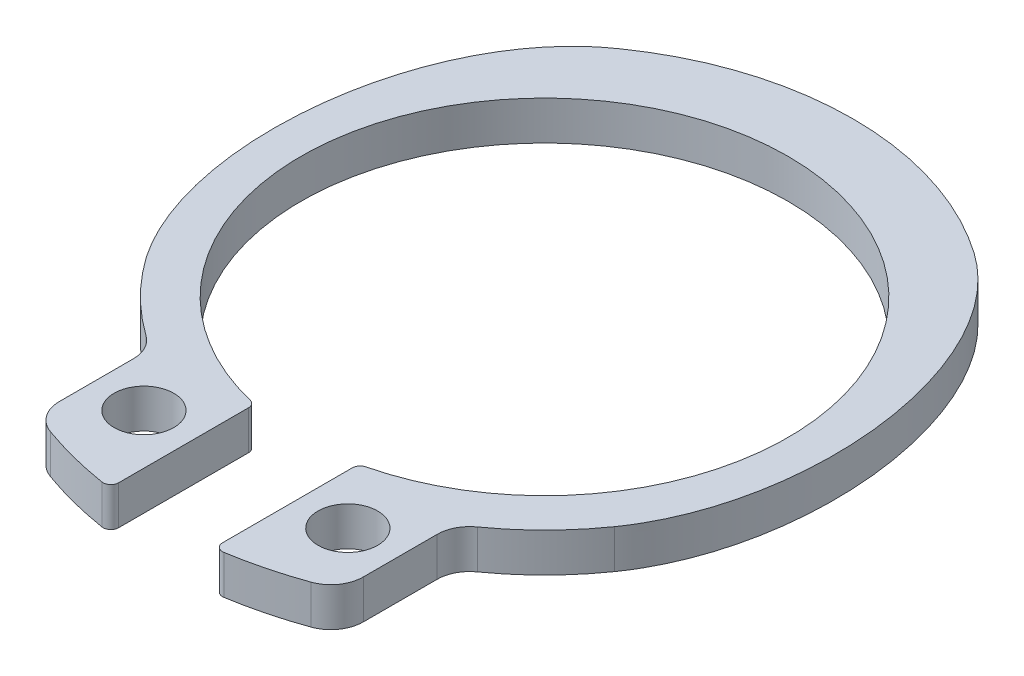
ISO-10303-21;
HEADER;
FILE_DESCRIPTION(('STEP AP214'),'2;1');
FILE_NAME('part.step','',(''),(''),'','','');
FILE_SCHEMA(('AUTOMOTIVE_DESIGN { 1 0 10303 214 1 1 1 1 }'));
ENDSEC;
DATA;
#1=APPLICATION_CONTEXT('core data for automotive mechanical design processes');
#2=APPLICATION_PROTOCOL_DEFINITION('international standard','automotive_design',2000,#1);
#3=PRODUCT_CONTEXT('',#1,'mechanical');
#4=PRODUCT('Part','Part','',(#3));
#5=PRODUCT_RELATED_PRODUCT_CATEGORY('part','',(#4));
#6=PRODUCT_DEFINITION_FORMATION('','',#4);
#7=PRODUCT_DEFINITION_CONTEXT('part definition',#1,'design');
#8=PRODUCT_DEFINITION('design','',#6,#7);
#9=PRODUCT_DEFINITION_SHAPE('','',#8);
#10=(LENGTH_UNIT() NAMED_UNIT(*) SI_UNIT(.MILLI.,.METRE.));
#11=(NAMED_UNIT(*) PLANE_ANGLE_UNIT() SI_UNIT($,.RADIAN.));
#12=(NAMED_UNIT(*) SI_UNIT($,.STERADIAN.) SOLID_ANGLE_UNIT());
#13=UNCERTAINTY_MEASURE_WITH_UNIT(LENGTH_MEASURE(1.E-05),#10,'distance_accuracy_value','');
#14=(GEOMETRIC_REPRESENTATION_CONTEXT(3) GLOBAL_UNCERTAINTY_ASSIGNED_CONTEXT((#13)) GLOBAL_UNIT_ASSIGNED_CONTEXT((#10,
#11,#12)) REPRESENTATION_CONTEXT('',''));
#15=CARTESIAN_POINT('',(0.,0.,0.));
#16=DIRECTION('',(0.,0.,1.));
#17=DIRECTION('',(1.,0.,0.));
#18=AXIS2_PLACEMENT_3D('',#15,#16,#17);
#19=CARTESIAN_POINT('',(-0.92,0.3,5.756952318719));
#20=DIRECTION('',(0.,-1.,0.));
#21=DIRECTION('',(0.,0.,-1.));
#22=AXIS2_PLACEMENT_3D('',#19,#20,#21);
#23=CYLINDRICAL_SURFACE('',#22,0.119999999999949);
#24=CARTESIAN_POINT('',(-0.92,-0.3,5.756952318719));
#25=DIRECTION('',(0.,-1.,0.));
#26=DIRECTION('',(0.,0.,-1.));
#27=AXIS2_PLACEMENT_3D('',#24,#25,#26);
#28=CIRCLE('',#27,0.119999999999949);
#29=CARTESIAN_POINT('',(-0.8,-0.3,5.756952318719));
#30=VERTEX_POINT('',#29);
#31=CARTESIAN_POINT('',(-0.938936535162845,-0.3,5.87544876438722));
#32=VERTEX_POINT('',#31);
#33=EDGE_CURVE('E202',#30,#32,#28,.T.);
#34=ORIENTED_EDGE('',*,*,#33,.F.);
#35=DIRECTION('',(0.,-1.,0.));
#36=VECTOR('',#35,1.);
#37=CARTESIAN_POINT('',(-0.8,0.3,5.756952318719));
#38=LINE('',#37,#36);
#39=CARTESIAN_POINT('',(-0.8,0.3,5.756952318719));
#40=VERTEX_POINT('',#39);
#41=EDGE_CURVE('E11',#40,#30,#38,.T.);
#42=ORIENTED_EDGE('',*,*,#41,.F.);
#43=CARTESIAN_POINT('',(-0.92,0.3,5.756952318719));
#44=DIRECTION('',(0.,-1.,0.));
#45=DIRECTION('',(0.,0.,-1.));
#46=AXIS2_PLACEMENT_3D('',#43,#44,#45);
#47=CIRCLE('',#46,0.119999999999949);
#48=CARTESIAN_POINT('',(-0.938936535162845,0.3,5.87544876438722));
#49=VERTEX_POINT('',#48);
#50=EDGE_CURVE('E269',#40,#49,#47,.T.);
#51=ORIENTED_EDGE('',*,*,#50,.T.);
#52=DIRECTION('',(0.,-1.,0.));
#53=VECTOR('',#52,1.);
#54=CARTESIAN_POINT('',(-0.938936535162845,0.3,5.87544876438722));
#55=LINE('',#54,#53);
#56=EDGE_CURVE('E36',#49,#32,#55,.T.);
#57=ORIENTED_EDGE('',*,*,#56,.T.);
#58=EDGE_LOOP('',(#34,#42,#51,#57));
#59=FACE_BOUND('',#58,.T.);
#60=ADVANCED_FACE('F33',(#59),#23,.T.);
#61=CARTESIAN_POINT('',(-0.8,0.3,3.759055732495));
#62=DIRECTION('',(1.,0.,0.));
#63=DIRECTION('',(0.,0.,-1.));
#64=AXIS2_PLACEMENT_3D('',#61,#62,#63);
#65=PLANE('',#64);
#66=DIRECTION('',(0.,0.,1.));
#67=VECTOR('',#66,1.);
#68=CARTESIAN_POINT('',(-0.8,-0.3,3.759055732495));
#69=LINE('',#68,#67);
#70=CARTESIAN_POINT('',(-0.8,-0.3,3.759055732495));
#71=VERTEX_POINT('',#70);
#72=EDGE_CURVE('E267',#71,#30,#69,.T.);
#73=ORIENTED_EDGE('',*,*,#72,.F.);
#74=DIRECTION('',(0.,-1.,0.));
#75=VECTOR('',#74,1.);
#76=CARTESIAN_POINT('',(-0.8,0.3,3.759055732495));
#77=LINE('',#76,#75);
#78=CARTESIAN_POINT('',(-0.8,0.3,3.759055732495));
#79=VERTEX_POINT('',#78);
#80=EDGE_CURVE('E42',#79,#71,#77,.T.);
#81=ORIENTED_EDGE('',*,*,#80,.F.);
#82=DIRECTION('',(0.,0.,1.));
#83=VECTOR('',#82,1.);
#84=CARTESIAN_POINT('',(-0.8,0.3,3.759055732495));
#85=LINE('',#84,#83);
#86=EDGE_CURVE('E192',#79,#40,#85,.T.);
#87=ORIENTED_EDGE('',*,*,#86,.T.);
#88=ORIENTED_EDGE('',*,*,#41,.T.);
#89=EDGE_LOOP('',(#73,#81,#87,#88));
#90=FACE_BOUND('',#89,.T.);
#91=ADVANCED_FACE('F305',(#90),#65,.T.);
#92=CARTESIAN_POINT('',(-0.92,0.3,3.759055732495));
#93=DIRECTION('',(0.,-1.,0.));
#94=DIRECTION('',(0.,0.,-1.));
#95=AXIS2_PLACEMENT_3D('',#92,#93,#94);
#96=CYLINDRICAL_SURFACE('',#95,0.120000000000044);
#97=CARTESIAN_POINT('',(-0.92,-0.3,3.759055732495));
#98=DIRECTION('',(0.,-1.,0.));
#99=DIRECTION('',(0.,0.,-1.));
#100=AXIS2_PLACEMENT_3D('',#97,#98,#99);
#101=CIRCLE('',#100,0.120000000000044);
#102=CARTESIAN_POINT('',(-0.891472868217151,-0.3,3.64249586482068));
#103=VERTEX_POINT('',#102);
#104=EDGE_CURVE('E179',#103,#71,#101,.T.);
#105=ORIENTED_EDGE('',*,*,#104,.F.);
#106=DIRECTION('',(0.,-1.,0.));
#107=VECTOR('',#106,1.);
#108=CARTESIAN_POINT('',(-0.891472868217151,0.3,3.64249586482068));
#109=LINE('',#108,#107);
#110=CARTESIAN_POINT('',(-0.891472868217151,0.3,3.64249586482068));
#111=VERTEX_POINT('',#110);
#112=EDGE_CURVE('E174',#111,#103,#109,.T.);
#113=ORIENTED_EDGE('',*,*,#112,.F.);
#114=CARTESIAN_POINT('',(-0.92,0.3,3.759055732495));
#115=DIRECTION('',(0.,-1.,0.));
#116=DIRECTION('',(0.,0.,-1.));
#117=AXIS2_PLACEMENT_3D('',#114,#115,#116);
#118=CIRCLE('',#117,0.120000000000044);
#119=EDGE_CURVE('E177',#111,#79,#118,.T.);
#120=ORIENTED_EDGE('',*,*,#119,.T.);
#121=ORIENTED_EDGE('',*,*,#80,.T.);
#122=EDGE_LOOP('',(#105,#113,#120,#121));
#123=FACE_BOUND('',#122,.T.);
#124=ADVANCED_FACE('F176',(#123),#96,.T.);
#125=CARTESIAN_POINT('',(0.,0.3,1.58727198051878E-13));
#126=DIRECTION('',(0.,-1.,0.));
#127=DIRECTION('',(0.,0.,-1.));
#128=AXIS2_PLACEMENT_3D('',#125,#126,#127);
#129=CYLINDRICAL_SURFACE('',#128,3.75000000000021);
#130=CARTESIAN_POINT('',(0.,-0.3,1.58727198051878E-13));
#131=DIRECTION('',(0.,1.,0.));
#132=DIRECTION('',(0.,0.,1.));
#133=AXIS2_PLACEMENT_3D('',#130,#131,#132);
#134=CIRCLE('',#133,3.75000000000021);
#135=CARTESIAN_POINT('',(0.891472868216974,-0.3,3.64249586482067));
#136=VERTEX_POINT('',#135);
#137=EDGE_CURVE('E264',#136,#103,#134,.T.);
#138=ORIENTED_EDGE('',*,*,#137,.F.);
#139=DIRECTION('',(0.,-1.,0.));
#140=VECTOR('',#139,1.);
#141=CARTESIAN_POINT('',(0.891472868216974,0.3,3.64249586482067));
#142=LINE('',#141,#140);
#143=CARTESIAN_POINT('',(0.891472868216974,0.3,3.64249586482067));
#144=VERTEX_POINT('',#143);
#145=EDGE_CURVE('E184',#144,#136,#142,.T.);
#146=ORIENTED_EDGE('',*,*,#145,.F.);
#147=CARTESIAN_POINT('',(0.,0.3,1.58727198051878E-13));
#148=DIRECTION('',(0.,1.,0.));
#149=DIRECTION('',(0.,0.,1.));
#150=AXIS2_PLACEMENT_3D('',#147,#148,#149);
#151=CIRCLE('',#150,3.75000000000021);
#152=EDGE_CURVE('E190',#144,#111,#151,.T.);
#153=ORIENTED_EDGE('',*,*,#152,.T.);
#154=ORIENTED_EDGE('',*,*,#112,.T.);
#155=EDGE_LOOP('',(#138,#146,#153,#154));
#156=FACE_BOUND('',#155,.T.);
#157=ADVANCED_FACE('F194',(#156),#129,.F.);
#158=CARTESIAN_POINT('',(0.92,0.3,3.759055732495));
#159=DIRECTION('',(0.,-1.,0.));
#160=DIRECTION('',(0.,0.,-1.));
#161=AXIS2_PLACEMENT_3D('',#158,#159,#160);
#162=CYLINDRICAL_SURFACE('',#161,0.120000000000135);
#163=CARTESIAN_POINT('',(0.92,-0.3,3.759055732495));
#164=DIRECTION('',(0.,-1.,0.));
#165=DIRECTION('',(0.,0.,-1.));
#166=AXIS2_PLACEMENT_3D('',#163,#164,#165);
#167=CIRCLE('',#166,0.120000000000135);
#168=CARTESIAN_POINT('',(0.799999999999865,-0.3,3.75905573249503));
#169=VERTEX_POINT('',#168);
#170=EDGE_CURVE('E261',#169,#136,#167,.T.);
#171=ORIENTED_EDGE('',*,*,#170,.F.);
#172=DIRECTION('',(0.,-1.,0.));
#173=VECTOR('',#172,1.);
#174=CARTESIAN_POINT('',(0.799999999999865,0.3,3.75905573249503));
#175=LINE('',#174,#173);
#176=CARTESIAN_POINT('',(0.799999999999865,0.3,3.75905573249503));
#177=VERTEX_POINT('',#176);
#178=EDGE_CURVE('E273',#177,#169,#175,.T.);
#179=ORIENTED_EDGE('',*,*,#178,.F.);
#180=CARTESIAN_POINT('',(0.92,0.3,3.759055732495));
#181=DIRECTION('',(0.,-1.,0.));
#182=DIRECTION('',(0.,0.,-1.));
#183=AXIS2_PLACEMENT_3D('',#180,#181,#182);
#184=CIRCLE('',#183,0.120000000000135);
#185=EDGE_CURVE('E195',#177,#144,#184,.T.);
#186=ORIENTED_EDGE('',*,*,#185,.T.);
#187=ORIENTED_EDGE('',*,*,#145,.T.);
#188=EDGE_LOOP('',(#171,#179,#186,#187));
#189=FACE_BOUND('',#188,.T.);
#190=ADVANCED_FACE('F318',(#189),#162,.T.);
#191=CARTESIAN_POINT('',(0.799999999999829,0.3,5.75695231871912));
#192=DIRECTION('',(-1.,0.,0.));
#193=DIRECTION('',(0.,0.,1.));
#194=AXIS2_PLACEMENT_3D('',#191,#192,#193);
#195=PLANE('',#194);
#196=DIRECTION('',(0.,0.,-1.));
#197=VECTOR('',#196,1.);
#198=CARTESIAN_POINT('',(0.799999999999829,-0.3,5.75695231871912));
#199=LINE('',#198,#197);
#200=CARTESIAN_POINT('',(0.799999999999829,-0.3,5.75695231871912));
#201=VERTEX_POINT('',#200);
#202=EDGE_CURVE('E258',#201,#169,#199,.T.);
#203=ORIENTED_EDGE('',*,*,#202,.F.);
#204=DIRECTION('',(0.,-1.,0.));
#205=VECTOR('',#204,1.);
#206=CARTESIAN_POINT('',(0.799999999999829,0.3,5.75695231871912));
#207=LINE('',#206,#205);
#208=CARTESIAN_POINT('',(0.799999999999829,0.3,5.75695231871912));
#209=VERTEX_POINT('',#208);
#210=EDGE_CURVE('E275',#209,#201,#207,.T.);
#211=ORIENTED_EDGE('',*,*,#210,.F.);
#212=DIRECTION('',(0.,0.,-1.));
#213=VECTOR('',#212,1.);
#214=CARTESIAN_POINT('',(0.799999999999829,0.3,5.75695231871912));
#215=LINE('',#214,#213);
#216=EDGE_CURVE('E197',#209,#177,#215,.T.);
#217=ORIENTED_EDGE('',*,*,#216,.T.);
#218=ORIENTED_EDGE('',*,*,#178,.T.);
#219=EDGE_LOOP('',(#203,#211,#217,#218));
#220=FACE_BOUND('',#219,.T.);
#221=ADVANCED_FACE('F321',(#220),#195,.T.);
#222=CARTESIAN_POINT('',(0.919999999999655,0.3,5.75695231871912));
#223=DIRECTION('',(0.,-1.,0.));
#224=DIRECTION('',(0.,0.,-1.));
#225=AXIS2_PLACEMENT_3D('',#222,#223,#224);
#226=CYLINDRICAL_SURFACE('',#225,0.119999999999825);
#227=CARTESIAN_POINT('',(0.919999999999655,-0.3,5.75695231871912));
#228=DIRECTION('',(0.,-1.,0.));
#229=DIRECTION('',(0.,0.,-1.));
#230=AXIS2_PLACEMENT_3D('',#227,#228,#229);
#231=CIRCLE('',#230,0.119999999999825);
#232=CARTESIAN_POINT('',(0.938936535162571,-0.3,5.87544876438726));
#233=VERTEX_POINT('',#232);
#234=EDGE_CURVE('E255',#233,#201,#231,.T.);
#235=ORIENTED_EDGE('',*,*,#234,.F.);
#236=DIRECTION('',(0.,-1.,0.));
#237=VECTOR('',#236,1.);
#238=CARTESIAN_POINT('',(0.938936535162571,0.3,5.87544876438726));
#239=LINE('',#238,#237);
#240=CARTESIAN_POINT('',(0.938936535162571,0.3,5.87544876438726));
#241=VERTEX_POINT('',#240);
#242=EDGE_CURVE('E277',#241,#233,#239,.T.);
#243=ORIENTED_EDGE('',*,*,#242,.F.);
#244=CARTESIAN_POINT('',(0.919999999999655,0.3,5.75695231871912));
#245=DIRECTION('',(0.,-1.,0.));
#246=DIRECTION('',(0.,0.,-1.));
#247=AXIS2_PLACEMENT_3D('',#244,#245,#246);
#248=CIRCLE('',#247,0.119999999999825);
#249=EDGE_CURVE('E384',#241,#209,#248,.T.);
#250=ORIENTED_EDGE('',*,*,#249,.T.);
#251=ORIENTED_EDGE('',*,*,#210,.T.);
#252=EDGE_LOOP('',(#235,#243,#250,#251));
#253=FACE_BOUND('',#252,.T.);
#254=ADVANCED_FACE('F325',(#253),#226,.T.);
#255=CARTESIAN_POINT('',(0.,0.3,1.58727198051878E-13));
#256=DIRECTION('',(0.,-1.,0.));
#257=DIRECTION('',(0.,0.,-1.));
#258=AXIS2_PLACEMENT_3D('',#255,#256,#257);
#259=CYLINDRICAL_SURFACE('',#258,5.95000000000009);
#260=CARTESIAN_POINT('',(0.,-0.3,1.58727198051878E-13));
#261=DIRECTION('',(0.,-1.,0.));
#262=DIRECTION('',(0.,0.,-1.));
#263=AXIS2_PLACEMENT_3D('',#260,#261,#262);
#264=CIRCLE('',#263,5.95000000000009);
#265=CARTESIAN_POINT('',(2.00880733944943,-0.3,5.60064220183514));
#266=VERTEX_POINT('',#265);
#267=EDGE_CURVE('E252',#266,#233,#264,.T.);
#268=ORIENTED_EDGE('',*,*,#267,.F.);
#269=DIRECTION('',(0.,-1.,0.));
#270=VECTOR('',#269,1.);
#271=CARTESIAN_POINT('',(2.00880733944943,0.3,5.60064220183514));
#272=LINE('',#271,#270);
#273=CARTESIAN_POINT('',(2.00880733944943,0.3,5.60064220183514));
#274=VERTEX_POINT('',#273);
#275=EDGE_CURVE('E279',#274,#266,#272,.T.);
#276=ORIENTED_EDGE('',*,*,#275,.F.);
#277=CARTESIAN_POINT('',(0.,0.3,1.58727198051878E-13));
#278=DIRECTION('',(0.,-1.,0.));
#279=DIRECTION('',(0.,0.,-1.));
#280=AXIS2_PLACEMENT_3D('',#277,#278,#279);
#281=CIRCLE('',#280,5.95000000000009);
#282=EDGE_CURVE('E381',#274,#241,#281,.T.);
#283=ORIENTED_EDGE('',*,*,#282,.T.);
#284=ORIENTED_EDGE('',*,*,#242,.T.);
#285=EDGE_LOOP('',(#268,#276,#283,#284));
#286=FACE_BOUND('',#285,.T.);
#287=ADVANCED_FACE('F329',(#286),#259,.T.);
#288=CARTESIAN_POINT('',(1.8399999999999,0.3,5.13000000000028));
#289=DIRECTION('',(0.,-1.,0.));
#290=DIRECTION('',(0.,0.,-1.));
#291=AXIS2_PLACEMENT_3D('',#288,#289,#290);
#292=CYLINDRICAL_SURFACE('',#291,0.5);
#293=CARTESIAN_POINT('',(1.8399999999999,-0.3,5.13000000000028));
#294=DIRECTION('',(0.,-1.,0.));
#295=DIRECTION('',(0.,0.,-1.));
#296=AXIS2_PLACEMENT_3D('',#293,#294,#295);
#297=CIRCLE('',#296,0.5);
#298=CARTESIAN_POINT('',(2.3399999999999,-0.3,5.13000000000028));
#299=VERTEX_POINT('',#298);
#300=EDGE_CURVE('E249',#299,#266,#297,.T.);
#301=ORIENTED_EDGE('',*,*,#300,.F.);
#302=DIRECTION('',(0.,-1.,0.));
#303=VECTOR('',#302,1.);
#304=CARTESIAN_POINT('',(2.3399999999999,0.3,5.13000000000028));
#305=LINE('',#304,#303);
#306=CARTESIAN_POINT('',(2.3399999999999,0.3,5.13000000000028));
#307=VERTEX_POINT('',#306);
#308=EDGE_CURVE('E281',#307,#299,#305,.T.);
#309=ORIENTED_EDGE('',*,*,#308,.F.);
#310=CARTESIAN_POINT('',(1.8399999999999,0.3,5.13000000000028));
#311=DIRECTION('',(0.,-1.,0.));
#312=DIRECTION('',(0.,0.,-1.));
#313=AXIS2_PLACEMENT_3D('',#310,#311,#312);
#314=CIRCLE('',#313,0.5);
#315=EDGE_CURVE('E378',#307,#274,#314,.T.);
#316=ORIENTED_EDGE('',*,*,#315,.T.);
#317=ORIENTED_EDGE('',*,*,#275,.T.);
#318=EDGE_LOOP('',(#301,#309,#316,#317));
#319=FACE_BOUND('',#318,.T.);
#320=ADVANCED_FACE('F333',(#319),#292,.T.);
#321=CARTESIAN_POINT('',(2.34,0.3,3.993043951674));
#322=DIRECTION('',(1.,0.,0.));
#323=DIRECTION('',(0.,0.,-1.));
#324=AXIS2_PLACEMENT_3D('',#321,#322,#323);
#325=PLANE('',#324);
#326=DIRECTION('',(0.,0.,1.));
#327=VECTOR('',#326,1.);
#328=CARTESIAN_POINT('',(2.34,-0.3,3.993043951674));
#329=LINE('',#328,#327);
#330=CARTESIAN_POINT('',(2.34,-0.3,3.993043951674));
#331=VERTEX_POINT('',#330);
#332=EDGE_CURVE('E246',#331,#299,#329,.T.);
#333=ORIENTED_EDGE('',*,*,#332,.F.);
#334=DIRECTION('',(0.,-1.,0.));
#335=VECTOR('',#334,1.);
#336=CARTESIAN_POINT('',(2.34,0.3,3.993043951674));
#337=LINE('',#336,#335);
#338=CARTESIAN_POINT('',(2.34,0.3,3.993043951674));
#339=VERTEX_POINT('',#338);
#340=EDGE_CURVE('E283',#339,#331,#337,.T.);
#341=ORIENTED_EDGE('',*,*,#340,.F.);
#342=DIRECTION('',(0.,0.,1.));
#343=VECTOR('',#342,1.);
#344=CARTESIAN_POINT('',(2.34,0.3,3.993043951674));
#345=LINE('',#344,#343);
#346=EDGE_CURVE('E375',#339,#307,#345,.T.);
#347=ORIENTED_EDGE('',*,*,#346,.T.);
#348=ORIENTED_EDGE('',*,*,#308,.T.);
#349=EDGE_LOOP('',(#333,#341,#347,#348));
#350=FACE_BOUND('',#349,.T.);
#351=ADVANCED_FACE('F337',(#350),#325,.T.);
#352=CARTESIAN_POINT('',(2.84,0.3,3.993043951674));
#353=DIRECTION('',(0.,-1.,0.));
#354=DIRECTION('',(0.,0.,-1.));
#355=AXIS2_PLACEMENT_3D('',#352,#353,#354);
#356=CYLINDRICAL_SURFACE('',#355,0.500000000000002);
#357=CARTESIAN_POINT('',(2.84,-0.3,3.993043951674));
#358=DIRECTION('',(0.,1.,0.));
#359=DIRECTION('',(0.,0.,1.));
#360=AXIS2_PLACEMENT_3D('',#357,#358,#359);
#361=CIRCLE('',#360,0.500000000000002);
#362=CARTESIAN_POINT('',(2.55020408163256,-0.3,3.58559048721754));
#363=VERTEX_POINT('',#362);
#364=EDGE_CURVE('E243',#363,#331,#361,.T.);
#365=ORIENTED_EDGE('',*,*,#364,.F.);
#366=DIRECTION('',(0.,-1.,0.));
#367=VECTOR('',#366,1.);
#368=CARTESIAN_POINT('',(2.55020408163256,0.3,3.58559048721754));
#369=LINE('',#368,#367);
#370=CARTESIAN_POINT('',(2.55020408163256,0.3,3.58559048721754));
#371=VERTEX_POINT('',#370);
#372=EDGE_CURVE('E285',#371,#363,#369,.T.);
#373=ORIENTED_EDGE('',*,*,#372,.F.);
#374=CARTESIAN_POINT('',(2.84,0.3,3.993043951674));
#375=DIRECTION('',(0.,1.,0.));
#376=DIRECTION('',(0.,0.,1.));
#377=AXIS2_PLACEMENT_3D('',#374,#375,#376);
#378=CIRCLE('',#377,0.500000000000002);
#379=EDGE_CURVE('E372',#371,#339,#378,.T.);
#380=ORIENTED_EDGE('',*,*,#379,.T.);
#381=ORIENTED_EDGE('',*,*,#340,.T.);
#382=EDGE_LOOP('',(#365,#373,#380,#381));
#383=FACE_BOUND('',#382,.T.);
#384=ADVANCED_FACE('F341',(#383),#356,.F.);
#385=CARTESIAN_POINT('',(0.,0.3,1.58727198051878E-13));
#386=DIRECTION('',(0.,-1.,0.));
#387=DIRECTION('',(0.,0.,-1.));
#388=AXIS2_PLACEMENT_3D('',#385,#386,#387);
#389=CYLINDRICAL_SURFACE('',#388,4.39999999999991);
#390=CARTESIAN_POINT('',(0.,-0.3,1.58727198051878E-13));
#391=DIRECTION('',(0.,-1.,0.));
#392=DIRECTION('',(0.,0.,-1.));
#393=AXIS2_PLACEMENT_3D('',#390,#391,#392);
#394=CIRCLE('',#393,4.39999999999991);
#395=CARTESIAN_POINT('',(3.60426899487121,-0.3,2.52373631994509));
#396=VERTEX_POINT('',#395);
#397=EDGE_CURVE('E237',#396,#363,#394,.T.);
#398=ORIENTED_EDGE('',*,*,#397,.F.);
#399=DIRECTION('',(0.,-1.,0.));
#400=VECTOR('',#399,1.);
#401=CARTESIAN_POINT('',(3.60426899487121,0.3,2.52373631994509));
#402=LINE('',#401,#400);
#403=CARTESIAN_POINT('',(3.60426899487121,0.3,2.52373631994509));
#404=VERTEX_POINT('',#403);
#405=EDGE_CURVE('E287',#404,#396,#402,.T.);
#406=ORIENTED_EDGE('',*,*,#405,.F.);
#407=CARTESIAN_POINT('',(0.,0.3,1.58727198051878E-13));
#408=DIRECTION('',(0.,-1.,0.));
#409=DIRECTION('',(0.,0.,-1.));
#410=AXIS2_PLACEMENT_3D('',#407,#408,#409);
#411=CIRCLE('',#410,4.39999999999991);
#412=EDGE_CURVE('E364',#404,#371,#411,.T.);
#413=ORIENTED_EDGE('',*,*,#412,.T.);
#414=ORIENTED_EDGE('',*,*,#372,.T.);
#415=EDGE_LOOP('',(#398,#406,#413,#414));
#416=FACE_BOUND('',#415,.T.);
#417=ADVANCED_FACE('F345',(#416),#389,.T.);
#418=CARTESIAN_POINT('',(2.72448807266698,0.3,-3.89097221037285));
#419=CARTESIAN_POINT('',(3.02256608005945,0.3,-3.68225574262217));
#420=CARTESIAN_POINT('',(3.28010361910521,0.3,-3.40940539468267));
#421=CARTESIAN_POINT('',(3.48806342040552,0.3,-3.11079899246643));
#422=CARTESIAN_POINT('',(3.76518579956995,0.3,-2.71288306785754));
#423=CARTESIAN_POINT('',(3.96673204813291,0.3,-2.2578948465849));
#424=CARTESIAN_POINT('',(4.10348922533253,0.3,-1.79267299566268));
#425=CARTESIAN_POINT('',(4.28909221014862,0.3,-1.16128701723764));
#426=CARTESIAN_POINT('',(4.36399571057634,0.3,-0.488820559159922));
#427=CARTESIAN_POINT('',(4.33114692969022,0.3,0.168459958822081));
#428=CARTESIAN_POINT('',(4.30420436289042,0.3,0.70756137398035));
#429=CARTESIAN_POINT('',(4.20355426164096,0.3,1.25200955492802));
#430=CARTESIAN_POINT('',(4.00852742755528,0.3,1.75531937175849));
#431=CARTESIAN_POINT('',(3.90395557561678,0.3,2.02519013026995));
#432=CARTESIAN_POINT('',(3.77027503498526,0.3,2.28665512464894));
#433=CARTESIAN_POINT('',(3.60426899487121,0.3,2.52373631994509));
#434=B_SPLINE_CURVE_WITH_KNOTS('',3,(#418,#419,#420,#421,#422,#423,#424,#425,#426,#427,#428,
#429,#430,#431,#432,#433),.UNSPECIFIED.,.F.,.F.,(4,3,3,3,3,4),(0.,0.00109165817068003,
0.00254766623711411,0.00452995101649428,0.00615197286598774,0.0070149463818994),.UNSPECIFIED.);
#435=DIRECTION('',(0.,-1.,0.));
#436=VECTOR('',#435,1.);
#437=SURFACE_OF_LINEAR_EXTRUSION('',#434,#436);
#438=CARTESIAN_POINT('',(2.72448807266698,-0.3,-3.89097221037285));
#439=CARTESIAN_POINT('',(3.02256608005945,-0.3,-3.68225574262217));
#440=CARTESIAN_POINT('',(3.28010361910521,-0.3,-3.40940539468267));
#441=CARTESIAN_POINT('',(3.48806342040552,-0.3,-3.11079899246643));
#442=CARTESIAN_POINT('',(3.76518579956995,-0.3,-2.71288306785754));
#443=CARTESIAN_POINT('',(3.96673204813291,-0.3,-2.2578948465849));
#444=CARTESIAN_POINT('',(4.10348922533253,-0.3,-1.79267299566268));
#445=CARTESIAN_POINT('',(4.28909221014862,-0.3,-1.16128701723764));
#446=CARTESIAN_POINT('',(4.36399571057634,-0.3,-0.488820559159922));
#447=CARTESIAN_POINT('',(4.33114692969022,-0.3,0.168459958822081));
#448=CARTESIAN_POINT('',(4.30420436289042,-0.3,0.70756137398035));
#449=CARTESIAN_POINT('',(4.20355426164096,-0.3,1.25200955492802));
#450=CARTESIAN_POINT('',(4.00852742755528,-0.3,1.75531937175849));
#451=CARTESIAN_POINT('',(3.90395557561678,-0.3,2.02519013026995));
#452=CARTESIAN_POINT('',(3.77027503498526,-0.3,2.28665512464894));
#453=CARTESIAN_POINT('',(3.60426899487121,-0.3,2.52373631994509));
#454=B_SPLINE_CURVE_WITH_KNOTS('',3,(#438,#439,#440,#441,#442,#443,#444,#445,#446,#447,#448,
#449,#450,#451,#452,#453),.UNSPECIFIED.,.F.,.F.,(4,3,3,3,3,4),(0.,0.00109165817068003,
0.00254766623711411,0.00452995101649428,0.00615197286598774,0.0070149463818994),.UNSPECIFIED.);
#455=CARTESIAN_POINT('',(2.72448807266698,-0.3,-3.89097221037285));
#456=VERTEX_POINT('',#455);
#457=EDGE_CURVE('E232',#456,#396,#454,.T.);
#458=ORIENTED_EDGE('',*,*,#457,.F.);
#459=DIRECTION('',(0.,-1.,0.));
#460=VECTOR('',#459,1.);
#461=CARTESIAN_POINT('',(2.72448807266698,0.3,-3.89097221037285));
#462=LINE('',#461,#460);
#463=CARTESIAN_POINT('',(2.72448807266698,0.3,-3.89097221037285));
#464=VERTEX_POINT('',#463);
#465=EDGE_CURVE('E289',#464,#456,#462,.T.);
#466=ORIENTED_EDGE('',*,*,#465,.F.);
#467=EDGE_CURVE('E357',#464,#404,#434,.T.);
#468=ORIENTED_EDGE('',*,*,#467,.T.);
#469=ORIENTED_EDGE('',*,*,#405,.T.);
#470=EDGE_LOOP('',(#458,#466,#468,#469));
#471=FACE_BOUND('',#470,.T.);
#472=ADVANCED_FACE('F349',(#471),#437,.T.);
#473=CARTESIAN_POINT('',(0.,0.3,1.58727198051878E-13));
#474=DIRECTION('',(0.,-1.,0.));
#475=DIRECTION('',(0.,0.,-1.));
#476=AXIS2_PLACEMENT_3D('',#473,#474,#475);
#477=CYLINDRICAL_SURFACE('',#476,4.75);
#478=CARTESIAN_POINT('',(0.,-0.3,1.58727198051878E-13));
#479=DIRECTION('',(0.,-1.,0.));
#480=DIRECTION('',(0.,0.,-1.));
#481=AXIS2_PLACEMENT_3D('',#478,#479,#480);
#482=CIRCLE('',#481,4.75);
#483=CARTESIAN_POINT('',(-2.72448807266701,-0.3,-3.89097221037289));
#484=VERTEX_POINT('',#483);
#485=EDGE_CURVE('E226',#484,#456,#482,.T.);
#486=ORIENTED_EDGE('',*,*,#485,.F.);
#487=DIRECTION('',(0.,-1.,0.));
#488=VECTOR('',#487,1.);
#489=CARTESIAN_POINT('',(-2.72448807266701,0.3,-3.89097221037289));
#490=LINE('',#489,#488);
#491=CARTESIAN_POINT('',(-2.72448807266701,0.3,-3.89097221037289));
#492=VERTEX_POINT('',#491);
#493=EDGE_CURVE('E291',#492,#484,#490,.T.);
#494=ORIENTED_EDGE('',*,*,#493,.F.);
#495=CARTESIAN_POINT('',(0.,0.3,1.58727198051878E-13));
#496=DIRECTION('',(0.,-1.,0.));
#497=DIRECTION('',(0.,0.,-1.));
#498=AXIS2_PLACEMENT_3D('',#495,#496,#497);
#499=CIRCLE('',#498,4.75);
#500=EDGE_CURVE('E365',#492,#464,#499,.T.);
#501=ORIENTED_EDGE('',*,*,#500,.T.);
#502=ORIENTED_EDGE('',*,*,#465,.T.);
#503=EDGE_LOOP('',(#486,#494,#501,#502));
#504=FACE_BOUND('',#503,.T.);
#505=ADVANCED_FACE('F354',(#504),#477,.T.);
#506=CARTESIAN_POINT('',(-3.60426899487148,0.3,2.52373631994477));
#507=CARTESIAN_POINT('',(-3.853924568271,0.3,2.15692757559025));
#508=CARTESIAN_POINT('',(-4.0295118454187,0.3,1.73583388208226));
#509=CARTESIAN_POINT('',(-4.14516915386851,0.3,1.30746494382164));
#510=CARTESIAN_POINT('',(-4.30817218118215,0.3,0.703737996692148));
#511=CARTESIAN_POINT('',(-4.36067547358156,0.3,0.0636348403127331));
#512=CARTESIAN_POINT('',(-4.32012449725951,0.3,-0.560393870503554));
#513=CARTESIAN_POINT('',(-4.27855369543626,0.3,-1.20011641783097));
#514=CARTESIAN_POINT('',(-4.13743855632988,0.3,-1.84593754748162));
#515=CARTESIAN_POINT('',(-3.87767640118186,0.3,-2.43202345575459));
#516=CARTESIAN_POINT('',(-3.72358388443932,0.3,-2.77969324076104));
#517=CARTESIAN_POINT('',(-3.52331205004396,0.3,-3.11305953479885));
#518=CARTESIAN_POINT('',(-3.27344430307666,0.3,-3.39973860998218));
#519=CARTESIAN_POINT('',(-3.11210437550351,0.3,-3.58484765982234));
#520=CARTESIAN_POINT('',(-2.92748369955068,0.3,-3.75281031972223));
#521=CARTESIAN_POINT('',(-2.72448807266704,0.3,-3.89097221037284));
#522=B_SPLINE_CURVE_WITH_KNOTS('',3,(#506,#507,#508,#509,#510,#511,#512,#513,#514,#515,#516,
#517,#518,#519,#520,#521),.UNSPECIFIED.,.F.,.F.,(4,3,3,3,3,4),(0.,0.0013311232258433,
0.00321195242003905,0.00514292191540708,0.00628010570335704,0.00701075947672847),.UNSPECIFIED.);
#523=DIRECTION('',(0.,-1.,0.));
#524=VECTOR('',#523,1.);
#525=SURFACE_OF_LINEAR_EXTRUSION('',#522,#524);
#526=CARTESIAN_POINT('',(-3.60426899487148,-0.3,2.52373631994477));
#527=CARTESIAN_POINT('',(-3.853924568271,-0.3,2.15692757559025));
#528=CARTESIAN_POINT('',(-4.0295118454187,-0.3,1.73583388208226));
#529=CARTESIAN_POINT('',(-4.14516915386851,-0.3,1.30746494382164));
#530=CARTESIAN_POINT('',(-4.30817218118215,-0.3,0.703737996692148));
#531=CARTESIAN_POINT('',(-4.36067547358156,-0.3,0.0636348403127331));
#532=CARTESIAN_POINT('',(-4.32012449725951,-0.3,-0.560393870503554));
#533=CARTESIAN_POINT('',(-4.27855369543626,-0.3,-1.20011641783097));
#534=CARTESIAN_POINT('',(-4.13743855632988,-0.3,-1.84593754748162));
#535=CARTESIAN_POINT('',(-3.87767640118186,-0.3,-2.43202345575459));
#536=CARTESIAN_POINT('',(-3.72358388443932,-0.3,-2.77969324076104));
#537=CARTESIAN_POINT('',(-3.52331205004396,-0.3,-3.11305953479885));
#538=CARTESIAN_POINT('',(-3.27344430307666,-0.3,-3.39973860998218));
#539=CARTESIAN_POINT('',(-3.11210437550351,-0.3,-3.58484765982234));
#540=CARTESIAN_POINT('',(-2.92748369955068,-0.3,-3.75281031972223));
#541=CARTESIAN_POINT('',(-2.72448807266704,-0.3,-3.89097221037284));
#542=B_SPLINE_CURVE_WITH_KNOTS('',3,(#526,#527,#528,#529,#530,#531,#532,#533,#534,#535,#536,
#537,#538,#539,#540,#541),.UNSPECIFIED.,.F.,.F.,(4,3,3,3,3,4),(0.,0.0013311232258433,
0.00321195242003905,0.00514292191540708,0.00628010570335704,0.00701075947672847),.UNSPECIFIED.);
#543=CARTESIAN_POINT('',(-3.60426899487148,-0.3,2.52373631994477));
#544=VERTEX_POINT('',#543);
#545=EDGE_CURVE('E221',#544,#484,#542,.T.);
#546=ORIENTED_EDGE('',*,*,#545,.F.);
#547=DIRECTION('',(0.,-1.,0.));
#548=VECTOR('',#547,1.);
#549=CARTESIAN_POINT('',(-3.60426899487148,0.3,2.52373631994477));
#550=LINE('',#549,#548);
#551=CARTESIAN_POINT('',(-3.60426899487148,0.3,2.52373631994477));
#552=VERTEX_POINT('',#551);
#553=EDGE_CURVE('E293',#552,#544,#550,.T.);
#554=ORIENTED_EDGE('',*,*,#553,.F.);
#555=EDGE_CURVE('E410',#552,#492,#522,.T.);
#556=ORIENTED_EDGE('',*,*,#555,.T.);
#557=ORIENTED_EDGE('',*,*,#493,.T.);
#558=EDGE_LOOP('',(#546,#554,#556,#557));
#559=FACE_BOUND('',#558,.T.);
#560=ADVANCED_FACE('F423',(#559),#525,.T.);
#561=CARTESIAN_POINT('',(0.,0.3,1.58727198051878E-13));
#562=DIRECTION('',(0.,-1.,0.));
#563=DIRECTION('',(0.,0.,-1.));
#564=AXIS2_PLACEMENT_3D('',#561,#562,#563);
#565=CYLINDRICAL_SURFACE('',#564,4.39999999999991);
#566=CARTESIAN_POINT('',(0.,-0.3,1.58727198051878E-13));
#567=DIRECTION('',(0.,-1.,0.));
#568=DIRECTION('',(0.,0.,-1.));
#569=AXIS2_PLACEMENT_3D('',#566,#567,#568);
#570=CIRCLE('',#569,4.39999999999991);
#571=CARTESIAN_POINT('',(-2.55020408163261,-0.3,3.58559048721753));
#572=VERTEX_POINT('',#571);
#573=EDGE_CURVE('E218',#572,#544,#570,.T.);
#574=ORIENTED_EDGE('',*,*,#573,.F.);
#575=DIRECTION('',(0.,-1.,0.));
#576=VECTOR('',#575,1.);
#577=CARTESIAN_POINT('',(-2.55020408163261,0.3,3.58559048721753));
#578=LINE('',#577,#576);
#579=CARTESIAN_POINT('',(-2.55020408163261,0.3,3.58559048721753));
#580=VERTEX_POINT('',#579);
#581=EDGE_CURVE('E295',#580,#572,#578,.T.);
#582=ORIENTED_EDGE('',*,*,#581,.F.);
#583=CARTESIAN_POINT('',(0.,0.3,1.58727198051878E-13));
#584=DIRECTION('',(0.,-1.,0.));
#585=DIRECTION('',(0.,0.,-1.));
#586=AXIS2_PLACEMENT_3D('',#583,#584,#585);
#587=CIRCLE('',#586,4.39999999999991);
#588=EDGE_CURVE('E411',#580,#552,#587,.T.);
#589=ORIENTED_EDGE('',*,*,#588,.T.);
#590=ORIENTED_EDGE('',*,*,#553,.T.);
#591=EDGE_LOOP('',(#574,#582,#589,#590));
#592=FACE_BOUND('',#591,.T.);
#593=ADVANCED_FACE('F426',(#592),#565,.T.);
#594=CARTESIAN_POINT('',(-2.84,0.3,3.993043951674));
#595=DIRECTION('',(0.,-1.,0.));
#596=DIRECTION('',(0.,0.,-1.));
#597=AXIS2_PLACEMENT_3D('',#594,#595,#596);
#598=CYLINDRICAL_SURFACE('',#597,0.499999999999987);
#599=CARTESIAN_POINT('',(-2.84,-0.3,3.993043951674));
#600=DIRECTION('',(0.,1.,0.));
#601=DIRECTION('',(0.,0.,1.));
#602=AXIS2_PLACEMENT_3D('',#599,#600,#601);
#603=CIRCLE('',#602,0.499999999999987);
#604=CARTESIAN_POINT('',(-2.34000000000001,-0.3,3.993043951674));
#605=VERTEX_POINT('',#604);
#606=EDGE_CURVE('E215',#605,#572,#603,.T.);
#607=ORIENTED_EDGE('',*,*,#606,.F.);
#608=DIRECTION('',(0.,-1.,0.));
#609=VECTOR('',#608,1.);
#610=CARTESIAN_POINT('',(-2.34000000000001,0.3,3.993043951674));
#611=LINE('',#610,#609);
#612=CARTESIAN_POINT('',(-2.34000000000001,0.3,3.993043951674));
#613=VERTEX_POINT('',#612);
#614=EDGE_CURVE('E297',#613,#605,#611,.T.);
#615=ORIENTED_EDGE('',*,*,#614,.F.);
#616=CARTESIAN_POINT('',(-2.84,0.3,3.993043951674));
#617=DIRECTION('',(0.,1.,0.));
#618=DIRECTION('',(0.,0.,1.));
#619=AXIS2_PLACEMENT_3D('',#616,#617,#618);
#620=CIRCLE('',#619,0.499999999999987);
#621=EDGE_CURVE('E414',#613,#580,#620,.T.);
#622=ORIENTED_EDGE('',*,*,#621,.T.);
#623=ORIENTED_EDGE('',*,*,#581,.T.);
#624=EDGE_LOOP('',(#607,#615,#622,#623));
#625=FACE_BOUND('',#624,.T.);
#626=ADVANCED_FACE('F429',(#625),#598,.F.);
#627=CARTESIAN_POINT('',(-2.33999999999996,0.3,5.13000000000028));
#628=DIRECTION('',(-1.,0.,0.));
#629=DIRECTION('',(0.,0.,1.));
#630=AXIS2_PLACEMENT_3D('',#627,#628,#629);
#631=PLANE('',#630);
#632=DIRECTION('',(0.,0.,-1.));
#633=VECTOR('',#632,1.);
#634=CARTESIAN_POINT('',(-2.33999999999996,-0.3,5.13000000000028));
#635=LINE('',#634,#633);
#636=CARTESIAN_POINT('',(-2.33999999999996,-0.3,5.13000000000028));
#637=VERTEX_POINT('',#636);
#638=EDGE_CURVE('E212',#637,#605,#635,.T.);
#639=ORIENTED_EDGE('',*,*,#638,.F.);
#640=DIRECTION('',(0.,-1.,0.));
#641=VECTOR('',#640,1.);
#642=CARTESIAN_POINT('',(-2.33999999999996,0.3,5.13000000000028));
#643=LINE('',#642,#641);
#644=CARTESIAN_POINT('',(-2.33999999999996,0.3,5.13000000000028));
#645=VERTEX_POINT('',#644);
#646=EDGE_CURVE('E299',#645,#637,#643,.T.);
#647=ORIENTED_EDGE('',*,*,#646,.F.);
#648=DIRECTION('',(0.,0.,-1.));
#649=VECTOR('',#648,1.);
#650=CARTESIAN_POINT('',(-2.33999999999996,0.3,5.13000000000028));
#651=LINE('',#650,#649);
#652=EDGE_CURVE('E482',#645,#613,#651,.T.);
#653=ORIENTED_EDGE('',*,*,#652,.T.);
#654=ORIENTED_EDGE('',*,*,#614,.T.);
#655=EDGE_LOOP('',(#639,#647,#653,#654));
#656=FACE_BOUND('',#655,.T.);
#657=ADVANCED_FACE('F433',(#656),#631,.T.);
#658=CARTESIAN_POINT('',(-1.83999999999996,0.3,5.13000000000028));
#659=DIRECTION('',(0.,-1.,0.));
#660=DIRECTION('',(0.,0.,-1.));
#661=AXIS2_PLACEMENT_3D('',#658,#659,#660);
#662=CYLINDRICAL_SURFACE('',#661,0.5);
#663=CARTESIAN_POINT('',(-1.83999999999996,-0.3,5.13000000000028));
#664=DIRECTION('',(0.,-1.,0.));
#665=DIRECTION('',(0.,0.,-1.));
#666=AXIS2_PLACEMENT_3D('',#663,#664,#665);
#667=CIRCLE('',#666,0.5);
#668=CARTESIAN_POINT('',(-2.00880733944949,-0.3,5.60064220183514));
#669=VERTEX_POINT('',#668);
#670=EDGE_CURVE('E209',#669,#637,#667,.T.);
#671=ORIENTED_EDGE('',*,*,#670,.F.);
#672=DIRECTION('',(0.,-1.,0.));
#673=VECTOR('',#672,1.);
#674=CARTESIAN_POINT('',(-2.00880733944949,0.3,5.60064220183514));
#675=LINE('',#674,#673);
#676=CARTESIAN_POINT('',(-2.00880733944949,0.3,5.60064220183514));
#677=VERTEX_POINT('',#676);
#678=EDGE_CURVE('E300',#677,#669,#675,.T.);
#679=ORIENTED_EDGE('',*,*,#678,.F.);
#680=CARTESIAN_POINT('',(-1.83999999999996,0.3,5.13000000000028));
#681=DIRECTION('',(0.,-1.,0.));
#682=DIRECTION('',(0.,0.,-1.));
#683=AXIS2_PLACEMENT_3D('',#680,#681,#682);
#684=CIRCLE('',#683,0.5);
#685=EDGE_CURVE('E479',#677,#645,#684,.T.);
#686=ORIENTED_EDGE('',*,*,#685,.T.);
#687=ORIENTED_EDGE('',*,*,#646,.T.);
#688=EDGE_LOOP('',(#671,#679,#686,#687));
#689=FACE_BOUND('',#688,.T.);
#690=ADVANCED_FACE('F437',(#689),#662,.T.);
#691=CARTESIAN_POINT('',(0.,0.3,1.58727198051878E-13));
#692=DIRECTION('',(0.,-1.,0.));
#693=DIRECTION('',(0.,0.,-1.));
#694=AXIS2_PLACEMENT_3D('',#691,#692,#693);
#695=CYLINDRICAL_SURFACE('',#694,5.95000000000009);
#696=CARTESIAN_POINT('',(0.,-0.3,1.58727198051878E-13));
#697=DIRECTION('',(0.,-1.,0.));
#698=DIRECTION('',(0.,0.,-1.));
#699=AXIS2_PLACEMENT_3D('',#696,#697,#698);
#700=CIRCLE('',#699,5.95000000000009);
#701=EDGE_CURVE('E205',#32,#669,#700,.T.);
#702=ORIENTED_EDGE('',*,*,#701,.F.);
#703=ORIENTED_EDGE('',*,*,#56,.F.);
#704=CARTESIAN_POINT('',(0.,0.3,1.58727198051878E-13));
#705=DIRECTION('',(0.,-1.,0.));
#706=DIRECTION('',(0.,0.,-1.));
#707=AXIS2_PLACEMENT_3D('',#704,#705,#706);
#708=CIRCLE('',#707,5.95000000000009);
#709=EDGE_CURVE('E477',#49,#677,#708,.T.);
#710=ORIENTED_EDGE('',*,*,#709,.T.);
#711=ORIENTED_EDGE('',*,*,#678,.T.);
#712=EDGE_LOOP('',(#702,#703,#710,#711));
#713=FACE_BOUND('',#712,.T.);
#714=ADVANCED_FACE('F302',(#713),#695,.T.);
#715=CARTESIAN_POINT('',(-0.92,0.3,5.756952318719));
#716=DIRECTION('',(0.,-1.,0.));
#717=DIRECTION('',(0.,0.,-1.));
#718=AXIS2_PLACEMENT_3D('',#715,#716,#717);
#719=PLANE('',#718);
#720=CARTESIAN_POINT('',(-1.57,0.3,4.598363042383));
#721=DIRECTION('',(0.,-1.,0.));
#722=DIRECTION('',(0.,0.,1.));
#723=AXIS2_PLACEMENT_3D('',#720,#721,#722);
#724=CIRCLE('',#723,0.4589960557251);
#725=CARTESIAN_POINT('',(-1.57,0.3,5.0573590981081));
#726=VERTEX_POINT('',#725);
#727=EDGE_CURVE('E464',#726,#726,#724,.T.);
#728=ORIENTED_EDGE('',*,*,#727,.T.);
#729=EDGE_LOOP('',(#728));
#730=FACE_BOUND('',#729,.T.);
#731=CARTESIAN_POINT('',(1.57,0.3,4.598363042383));
#732=DIRECTION('',(0.,-1.,0.));
#733=DIRECTION('',(0.,0.,1.));
#734=AXIS2_PLACEMENT_3D('',#731,#732,#733);
#735=CIRCLE('',#734,0.4589960557251);
#736=CARTESIAN_POINT('',(1.57,0.3,5.0573590981081));
#737=VERTEX_POINT('',#736);
#738=EDGE_CURVE('E206',#737,#737,#735,.T.);
#739=ORIENTED_EDGE('',*,*,#738,.T.);
#740=EDGE_LOOP('',(#739));
#741=FACE_BOUND('',#740,.T.);
#742=ORIENTED_EDGE('',*,*,#50,.F.);
#743=ORIENTED_EDGE('',*,*,#86,.F.);
#744=ORIENTED_EDGE('',*,*,#119,.F.);
#745=ORIENTED_EDGE('',*,*,#152,.F.);
#746=ORIENTED_EDGE('',*,*,#185,.F.);
#747=ORIENTED_EDGE('',*,*,#216,.F.);
#748=ORIENTED_EDGE('',*,*,#249,.F.);
#749=ORIENTED_EDGE('',*,*,#282,.F.);
#750=ORIENTED_EDGE('',*,*,#315,.F.);
#751=ORIENTED_EDGE('',*,*,#346,.F.);
#752=ORIENTED_EDGE('',*,*,#379,.F.);
#753=ORIENTED_EDGE('',*,*,#412,.F.);
#754=ORIENTED_EDGE('',*,*,#467,.F.);
#755=ORIENTED_EDGE('',*,*,#500,.F.);
#756=ORIENTED_EDGE('',*,*,#555,.F.);
#757=ORIENTED_EDGE('',*,*,#588,.F.);
#758=ORIENTED_EDGE('',*,*,#621,.F.);
#759=ORIENTED_EDGE('',*,*,#652,.F.);
#760=ORIENTED_EDGE('',*,*,#685,.F.);
#761=ORIENTED_EDGE('',*,*,#709,.F.);
#762=EDGE_LOOP('',(#742,#743,#744,#745,#746,#747,#748,#749,#750,#751,#752,#753,#754,#755,#756,
#757,#758,#759,#760,#761));
#763=FACE_BOUND('',#762,.T.);
#764=ADVANCED_FACE('F188',(#730,#741,#763),#719,.F.);
#765=CARTESIAN_POINT('',(-0.92,-0.3,5.756952318719));
#766=DIRECTION('',(0.,-1.,0.));
#767=DIRECTION('',(0.,0.,-1.));
#768=AXIS2_PLACEMENT_3D('',#765,#766,#767);
#769=PLANE('',#768);
#770=CARTESIAN_POINT('',(-1.57,-0.3,4.598363042383));
#771=DIRECTION('',(0.,-1.,0.));
#772=DIRECTION('',(0.,0.,1.));
#773=AXIS2_PLACEMENT_3D('',#770,#771,#772);
#774=CIRCLE('',#773,0.4589960557251);
#775=CARTESIAN_POINT('',(-1.57,-0.3,5.0573590981081));
#776=VERTEX_POINT('',#775);
#777=EDGE_CURVE('E467',#776,#776,#774,.T.);
#778=ORIENTED_EDGE('',*,*,#777,.F.);
#779=EDGE_LOOP('',(#778));
#780=FACE_BOUND('',#779,.T.);
#781=CARTESIAN_POINT('',(1.57,-0.3,4.598363042383));
#782=DIRECTION('',(0.,-1.,0.));
#783=DIRECTION('',(0.,0.,1.));
#784=AXIS2_PLACEMENT_3D('',#781,#782,#783);
#785=CIRCLE('',#784,0.4589960557251);
#786=CARTESIAN_POINT('',(1.57,-0.3,5.0573590981081));
#787=VERTEX_POINT('',#786);
#788=EDGE_CURVE('E469',#787,#787,#785,.T.);
#789=ORIENTED_EDGE('',*,*,#788,.F.);
#790=EDGE_LOOP('',(#789));
#791=FACE_BOUND('',#790,.T.);
#792=ORIENTED_EDGE('',*,*,#33,.T.);
#793=ORIENTED_EDGE('',*,*,#701,.T.);
#794=ORIENTED_EDGE('',*,*,#670,.T.);
#795=ORIENTED_EDGE('',*,*,#638,.T.);
#796=ORIENTED_EDGE('',*,*,#606,.T.);
#797=ORIENTED_EDGE('',*,*,#573,.T.);
#798=ORIENTED_EDGE('',*,*,#545,.T.);
#799=ORIENTED_EDGE('',*,*,#485,.T.);
#800=ORIENTED_EDGE('',*,*,#457,.T.);
#801=ORIENTED_EDGE('',*,*,#397,.T.);
#802=ORIENTED_EDGE('',*,*,#364,.T.);
#803=ORIENTED_EDGE('',*,*,#332,.T.);
#804=ORIENTED_EDGE('',*,*,#300,.T.);
#805=ORIENTED_EDGE('',*,*,#267,.T.);
#806=ORIENTED_EDGE('',*,*,#234,.T.);
#807=ORIENTED_EDGE('',*,*,#202,.T.);
#808=ORIENTED_EDGE('',*,*,#170,.T.);
#809=ORIENTED_EDGE('',*,*,#137,.T.);
#810=ORIENTED_EDGE('',*,*,#104,.T.);
#811=ORIENTED_EDGE('',*,*,#72,.T.);
#812=EDGE_LOOP('',(#792,#793,#794,#795,#796,#797,#798,#799,#800,#801,#802,#803,#804,#805,#806,
#807,#808,#809,#810,#811));
#813=FACE_BOUND('',#812,.T.);
#814=ADVANCED_FACE('F304',(#780,#791,#813),#769,.T.);
#815=CARTESIAN_POINT('',(1.57,0.3,4.598363042383));
#816=DIRECTION('',(0.,-1.,0.));
#817=DIRECTION('',(0.,0.,-1.));
#818=AXIS2_PLACEMENT_3D('',#815,#816,#817);
#819=CYLINDRICAL_SURFACE('',#818,0.4589960557251);
#820=ORIENTED_EDGE('',*,*,#738,.F.);
#821=EDGE_LOOP('',(#820));
#822=FACE_BOUND('',#821,.T.);
#823=ORIENTED_EDGE('',*,*,#788,.T.);
#824=EDGE_LOOP('',(#823));
#825=FACE_BOUND('',#824,.T.);
#826=ADVANCED_FACE('F449',(#822,#825),#819,.F.);
#827=CARTESIAN_POINT('',(-1.57,0.3,4.598363042383));
#828=DIRECTION('',(0.,-1.,0.));
#829=DIRECTION('',(0.,0.,-1.));
#830=AXIS2_PLACEMENT_3D('',#827,#828,#829);
#831=CYLINDRICAL_SURFACE('',#830,0.4589960557251);
#832=ORIENTED_EDGE('',*,*,#727,.F.);
#833=EDGE_LOOP('',(#832));
#834=FACE_BOUND('',#833,.T.);
#835=ORIENTED_EDGE('',*,*,#777,.T.);
#836=EDGE_LOOP('',(#835));
#837=FACE_BOUND('',#836,.T.);
#838=ADVANCED_FACE('F456',(#834,#837),#831,.F.);
#839=CLOSED_SHELL('',(#60,#91,#124,#157,#190,#221,#254,#287,#320,#351,#384,#417,#472,#505,#560,
#593,#626,#657,#690,#714,#764,#814,#826,#838));
#840=MANIFOLD_SOLID_BREP('B2',#839);
#841=ADVANCED_BREP_SHAPE_REPRESENTATION('',(#18,#840),#14);
#842=SHAPE_DEFINITION_REPRESENTATION(#9,#841);
ENDSEC;
END-ISO-10303-21;
